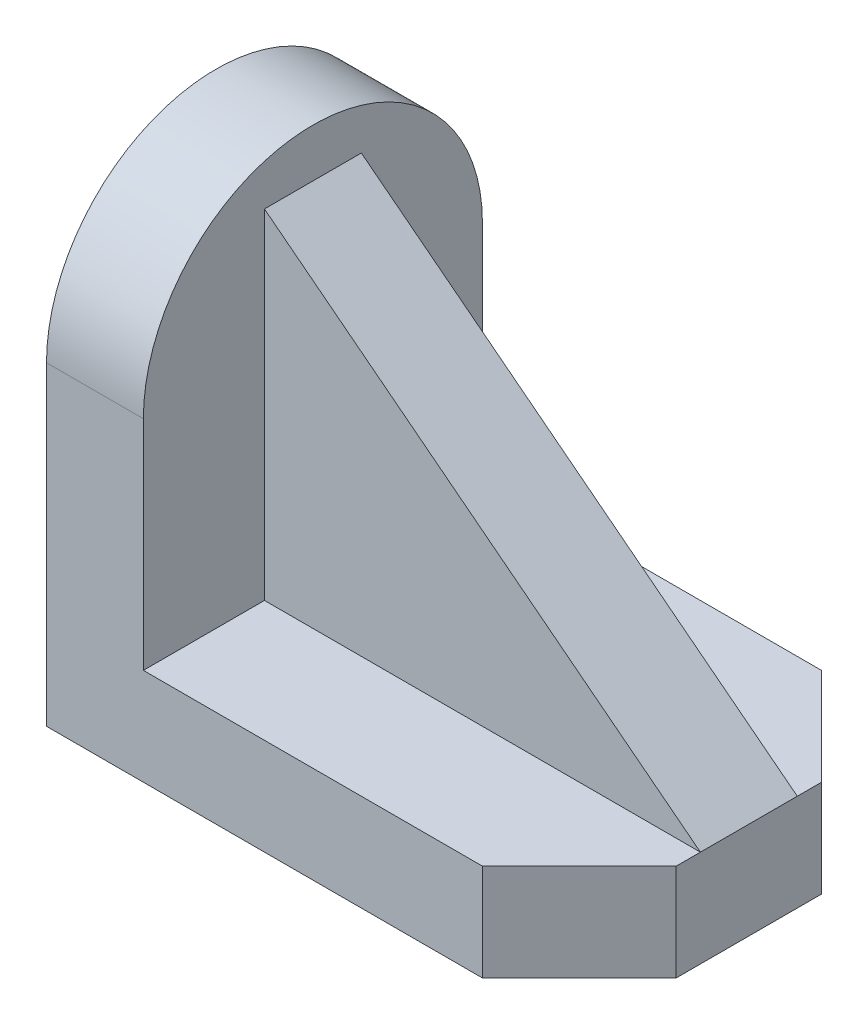
ISO-10303-21;
HEADER;
FILE_DESCRIPTION(('STEP AP214'),'2;1');
FILE_NAME('part.step','',(''),(''),'','','');
FILE_SCHEMA(('AUTOMOTIVE_DESIGN { 1 0 10303 214 1 1 1 1 }'));
ENDSEC;
DATA;
#1=APPLICATION_CONTEXT('core data for automotive mechanical design processes');
#2=APPLICATION_PROTOCOL_DEFINITION('international standard','automotive_design',2000,#1);
#3=PRODUCT_CONTEXT('',#1,'mechanical');
#4=PRODUCT('Part','Part','',(#3));
#5=PRODUCT_RELATED_PRODUCT_CATEGORY('part','',(#4));
#6=PRODUCT_DEFINITION_FORMATION('','',#4);
#7=PRODUCT_DEFINITION_CONTEXT('part definition',#1,'design');
#8=PRODUCT_DEFINITION('design','',#6,#7);
#9=PRODUCT_DEFINITION_SHAPE('','',#8);
#10=(LENGTH_UNIT() NAMED_UNIT(*) SI_UNIT(.MILLI.,.METRE.));
#11=(NAMED_UNIT(*) PLANE_ANGLE_UNIT() SI_UNIT($,.RADIAN.));
#12=(NAMED_UNIT(*) SI_UNIT($,.STERADIAN.) SOLID_ANGLE_UNIT());
#13=UNCERTAINTY_MEASURE_WITH_UNIT(LENGTH_MEASURE(1.E-05),#10,'distance_accuracy_value','');
#14=(GEOMETRIC_REPRESENTATION_CONTEXT(3) GLOBAL_UNCERTAINTY_ASSIGNED_CONTEXT((#13)) GLOBAL_UNIT_ASSIGNED_CONTEXT((#10,
#11,#12)) REPRESENTATION_CONTEXT('',''));
#15=CARTESIAN_POINT('',(0.,0.,0.));
#16=DIRECTION('',(0.,0.,1.));
#17=DIRECTION('',(1.,0.,0.));
#18=AXIS2_PLACEMENT_3D('',#15,#16,#17);
#19=CARTESIAN_POINT('',(0.,12.,0.));
#20=DIRECTION('',(0.,1.,0.));
#21=DIRECTION('',(0.,0.,1.));
#22=AXIS2_PLACEMENT_3D('',#19,#20,#21);
#23=PLANE('',#22);
#24=DIRECTION('',(0.,0.,-1.));
#25=VECTOR('',#24,1.);
#26=CARTESIAN_POINT('',(-21.,12.,0.));
#27=LINE('',#26,#25);
#28=CARTESIAN_POINT('',(-21.,12.,-6.));
#29=VERTEX_POINT('',#28);
#30=CARTESIAN_POINT('',(-21.,12.,-21.));
#31=VERTEX_POINT('',#30);
#32=EDGE_CURVE('E131',#29,#31,#27,.T.);
#33=ORIENTED_EDGE('',*,*,#32,.F.);
#34=DIRECTION('',(1.,0.,0.));
#35=VECTOR('',#34,1.);
#36=CARTESIAN_POINT('',(33.,12.,-6.));
#37=LINE('',#36,#35);
#38=CARTESIAN_POINT('',(33.,12.,-6.));
#39=VERTEX_POINT('',#38);
#40=EDGE_CURVE('E51',#29,#39,#37,.T.);
#41=ORIENTED_EDGE('',*,*,#40,.T.);
#42=DIRECTION('',(0.,0.,-1.));
#43=VECTOR('',#42,1.);
#44=CARTESIAN_POINT('',(33.,12.,-21.));
#45=LINE('',#44,#43);
#46=CARTESIAN_POINT('',(33.,12.,-8.99999999999997));
#47=VERTEX_POINT('',#46);
#48=EDGE_CURVE('E157',#39,#47,#45,.T.);
#49=ORIENTED_EDGE('',*,*,#48,.T.);
#50=DIRECTION('',(0.707106781186548,0.,0.707106781186548));
#51=VECTOR('',#50,1.);
#52=CARTESIAN_POINT('',(21.,12.,-21.));
#53=LINE('',#52,#51);
#54=CARTESIAN_POINT('',(21.,12.,-21.));
#55=VERTEX_POINT('',#54);
#56=EDGE_CURVE('E192',#47,#55,#53,.F.);
#57=ORIENTED_EDGE('',*,*,#56,.T.);
#58=DIRECTION('',(-1.,0.,0.));
#59=VECTOR('',#58,1.);
#60=CARTESIAN_POINT('',(-33.,12.,-21.));
#61=LINE('',#60,#59);
#62=EDGE_CURVE('E156',#55,#31,#61,.T.);
#63=ORIENTED_EDGE('',*,*,#62,.T.);
#64=EDGE_LOOP('',(#33,#41,#49,#57,#63));
#65=FACE_BOUND('',#64,.T.);
#66=ADVANCED_FACE('F35',(#65),#23,.T.);
#67=CARTESIAN_POINT('',(-21.,0.,0.));
#68=DIRECTION('',(1.,0.,0.));
#69=DIRECTION('',(0.,0.,-1.));
#70=AXIS2_PLACEMENT_3D('',#67,#68,#69);
#71=PLANE('',#70);
#72=DIRECTION('',(0.,0.,1.));
#73=VECTOR('',#72,1.);
#74=CARTESIAN_POINT('',(-21.,54.,-6.));
#75=LINE('',#74,#73);
#76=CARTESIAN_POINT('',(-21.,54.,-6.));
#77=VERTEX_POINT('',#76);
#78=CARTESIAN_POINT('',(-21.,54.,6.));
#79=VERTEX_POINT('',#78);
#80=EDGE_CURVE('E150',#77,#79,#75,.T.);
#81=ORIENTED_EDGE('',*,*,#80,.F.);
#82=DIRECTION('',(0.,-1.,0.));
#83=VECTOR('',#82,1.);
#84=CARTESIAN_POINT('',(-21.,12.,-6.));
#85=LINE('',#84,#83);
#86=EDGE_CURVE('E236',#77,#29,#85,.T.);
#87=ORIENTED_EDGE('',*,*,#86,.T.);
#88=ORIENTED_EDGE('',*,*,#32,.T.);
#89=DIRECTION('',(0.,1.,0.));
#90=VECTOR('',#89,1.);
#91=CARTESIAN_POINT('',(-21.,0.,-21.));
#92=LINE('',#91,#90);
#93=CARTESIAN_POINT('',(-21.,39.,-21.));
#94=VERTEX_POINT('',#93);
#95=EDGE_CURVE('E149',#31,#94,#92,.T.);
#96=ORIENTED_EDGE('',*,*,#95,.T.);
#97=CARTESIAN_POINT('',(-21.,39.,0.));
#98=DIRECTION('',(1.,0.,0.));
#99=DIRECTION('',(0.,0.,-1.));
#100=AXIS2_PLACEMENT_3D('',#97,#98,#99);
#101=CIRCLE('',#100,21.);
#102=CARTESIAN_POINT('',(-21.,39.,21.));
#103=VERTEX_POINT('',#102);
#104=EDGE_CURVE('E44',#94,#103,#101,.T.);
#105=ORIENTED_EDGE('',*,*,#104,.T.);
#106=DIRECTION('',(0.,1.,0.));
#107=VECTOR('',#106,1.);
#108=CARTESIAN_POINT('',(-21.,0.,21.));
#109=LINE('',#108,#107);
#110=CARTESIAN_POINT('',(-21.,12.,21.));
#111=VERTEX_POINT('',#110);
#112=EDGE_CURVE('E126',#111,#103,#109,.T.);
#113=ORIENTED_EDGE('',*,*,#112,.F.);
#114=CARTESIAN_POINT('',(-21.,12.,6.));
#115=VERTEX_POINT('',#114);
#116=EDGE_CURVE('E119',#111,#115,#27,.T.);
#117=ORIENTED_EDGE('',*,*,#116,.T.);
#118=DIRECTION('',(0.,-1.,0.));
#119=VECTOR('',#118,1.);
#120=CARTESIAN_POINT('',(-21.,12.,6.));
#121=LINE('',#120,#119);
#122=EDGE_CURVE('E123',#79,#115,#121,.T.);
#123=ORIENTED_EDGE('',*,*,#122,.F.);
#124=EDGE_LOOP('',(#81,#87,#88,#96,#105,#113,#117,#123));
#125=FACE_BOUND('',#124,.T.);
#126=ADVANCED_FACE('F121',(#125),#71,.T.);
#127=CARTESIAN_POINT('',(-21.,39.,0.));
#128=DIRECTION('',(-1.,0.,0.));
#129=DIRECTION('',(0.,0.,1.));
#130=AXIS2_PLACEMENT_3D('',#127,#128,#129);
#131=CYLINDRICAL_SURFACE('',#130,21.);
#132=DIRECTION('',(-1.,0.,0.));
#133=VECTOR('',#132,1.);
#134=CARTESIAN_POINT('',(-33.,39.,21.));
#135=LINE('',#134,#133);
#136=CARTESIAN_POINT('',(-33.,39.,21.));
#137=VERTEX_POINT('',#136);
#138=EDGE_CURVE('E196',#103,#137,#135,.T.);
#139=ORIENTED_EDGE('',*,*,#138,.F.);
#140=ORIENTED_EDGE('',*,*,#104,.F.);
#141=DIRECTION('',(-1.,0.,0.));
#142=VECTOR('',#141,1.);
#143=CARTESIAN_POINT('',(-33.,39.,-21.));
#144=LINE('',#143,#142);
#145=CARTESIAN_POINT('',(-33.,39.,-21.));
#146=VERTEX_POINT('',#145);
#147=EDGE_CURVE('E199',#146,#94,#144,.F.);
#148=ORIENTED_EDGE('',*,*,#147,.F.);
#149=CARTESIAN_POINT('',(-33.,39.,0.));
#150=DIRECTION('',(1.,0.,0.));
#151=DIRECTION('',(0.,0.,-1.));
#152=AXIS2_PLACEMENT_3D('',#149,#150,#151);
#153=CIRCLE('',#152,21.);
#154=EDGE_CURVE('E11',#137,#146,#153,.F.);
#155=ORIENTED_EDGE('',*,*,#154,.F.);
#156=EDGE_LOOP('',(#139,#140,#148,#155));
#157=FACE_BOUND('',#156,.T.);
#158=ADVANCED_FACE('F38',(#157),#131,.T.);
#159=CARTESIAN_POINT('',(33.,12.,-21.));
#160=DIRECTION('',(-1.,0.,0.));
#161=DIRECTION('',(0.,0.,1.));
#162=AXIS2_PLACEMENT_3D('',#159,#160,#161);
#163=PLANE('',#162);
#164=DIRECTION('',(0.,0.,-1.));
#165=VECTOR('',#164,1.);
#166=CARTESIAN_POINT('',(33.,0.,-21.));
#167=LINE('',#166,#165);
#168=CARTESIAN_POINT('',(33.,0.,8.99999999999996));
#169=VERTEX_POINT('',#168);
#170=CARTESIAN_POINT('',(33.,0.,-8.99999999999997));
#171=VERTEX_POINT('',#170);
#172=EDGE_CURVE('E130',#169,#171,#167,.T.);
#173=ORIENTED_EDGE('',*,*,#172,.T.);
#174=DIRECTION('',(0.,1.,0.));
#175=VECTOR('',#174,1.);
#176=CARTESIAN_POINT('',(33.,12.,-8.99999999999996));
#177=LINE('',#176,#175);
#178=EDGE_CURVE('E187',#171,#47,#177,.T.);
#179=ORIENTED_EDGE('',*,*,#178,.T.);
#180=ORIENTED_EDGE('',*,*,#48,.F.);
#181=DIRECTION('',(0.,0.,1.));
#182=VECTOR('',#181,1.);
#183=CARTESIAN_POINT('',(33.,12.,-6.));
#184=LINE('',#183,#182);
#185=CARTESIAN_POINT('',(33.,12.,5.99999999999999));
#186=VERTEX_POINT('',#185);
#187=EDGE_CURVE('E58',#39,#186,#184,.T.);
#188=ORIENTED_EDGE('',*,*,#187,.T.);
#189=CARTESIAN_POINT('',(33.,12.,8.99999999999996));
#190=VERTEX_POINT('',#189);
#191=EDGE_CURVE('E136',#190,#186,#45,.T.);
#192=ORIENTED_EDGE('',*,*,#191,.F.);
#193=DIRECTION('',(0.,-1.,0.));
#194=VECTOR('',#193,1.);
#195=CARTESIAN_POINT('',(33.,12.,8.99999999999996));
#196=LINE('',#195,#194);
#197=EDGE_CURVE('E184',#190,#169,#196,.T.);
#198=ORIENTED_EDGE('',*,*,#197,.T.);
#199=EDGE_LOOP('',(#173,#179,#180,#188,#192,#198));
#200=FACE_BOUND('',#199,.T.);
#201=ADVANCED_FACE('F214',(#200),#163,.F.);
#202=CARTESIAN_POINT('',(-33.,12.,-21.));
#203=DIRECTION('',(0.,0.,1.));
#204=DIRECTION('',(1.,0.,0.));
#205=AXIS2_PLACEMENT_3D('',#202,#203,#204);
#206=PLANE('',#205);
#207=DIRECTION('',(0.,-1.,0.));
#208=VECTOR('',#207,1.);
#209=CARTESIAN_POINT('',(-33.,12.,-21.));
#210=LINE('',#209,#208);
#211=CARTESIAN_POINT('',(-33.,0.,-21.));
#212=VERTEX_POINT('',#211);
#213=EDGE_CURVE('E175',#146,#212,#210,.T.);
#214=ORIENTED_EDGE('',*,*,#213,.F.);
#215=ORIENTED_EDGE('',*,*,#147,.T.);
#216=ORIENTED_EDGE('',*,*,#95,.F.);
#217=ORIENTED_EDGE('',*,*,#62,.F.);
#218=DIRECTION('',(0.,-1.,0.));
#219=VECTOR('',#218,1.);
#220=CARTESIAN_POINT('',(21.,12.,-21.));
#221=LINE('',#220,#219);
#222=CARTESIAN_POINT('',(21.,0.,-21.));
#223=VERTEX_POINT('',#222);
#224=EDGE_CURVE('E177',#55,#223,#221,.T.);
#225=ORIENTED_EDGE('',*,*,#224,.T.);
#226=DIRECTION('',(-1.,0.,0.));
#227=VECTOR('',#226,1.);
#228=CARTESIAN_POINT('',(-33.,0.,-21.));
#229=LINE('',#228,#227);
#230=EDGE_CURVE('E165',#223,#212,#229,.T.);
#231=ORIENTED_EDGE('',*,*,#230,.T.);
#232=EDGE_LOOP('',(#214,#215,#216,#217,#225,#231));
#233=FACE_BOUND('',#232,.T.);
#234=ADVANCED_FACE('F228',(#233),#206,.F.);
#235=CARTESIAN_POINT('',(-33.,12.,-21.));
#236=DIRECTION('',(1.,0.,0.));
#237=DIRECTION('',(0.,0.,-1.));
#238=AXIS2_PLACEMENT_3D('',#235,#236,#237);
#239=PLANE('',#238);
#240=DIRECTION('',(0.,-1.,0.));
#241=VECTOR('',#240,1.);
#242=CARTESIAN_POINT('',(-33.,12.,21.));
#243=LINE('',#242,#241);
#244=CARTESIAN_POINT('',(-33.,0.,21.));
#245=VERTEX_POINT('',#244);
#246=EDGE_CURVE('E162',#137,#245,#243,.T.);
#247=ORIENTED_EDGE('',*,*,#246,.F.);
#248=ORIENTED_EDGE('',*,*,#154,.T.);
#249=ORIENTED_EDGE('',*,*,#213,.T.);
#250=DIRECTION('',(0.,0.,1.));
#251=VECTOR('',#250,1.);
#252=CARTESIAN_POINT('',(-33.,0.,-21.));
#253=LINE('',#252,#251);
#254=EDGE_CURVE('E168',#212,#245,#253,.T.);
#255=ORIENTED_EDGE('',*,*,#254,.T.);
#256=EDGE_LOOP('',(#247,#248,#249,#255));
#257=FACE_BOUND('',#256,.T.);
#258=ADVANCED_FACE('F259',(#257),#239,.F.);
#259=CARTESIAN_POINT('',(-33.,12.,21.));
#260=DIRECTION('',(0.,0.,-1.));
#261=DIRECTION('',(-1.,0.,0.));
#262=AXIS2_PLACEMENT_3D('',#259,#260,#261);
#263=PLANE('',#262);
#264=ORIENTED_EDGE('',*,*,#112,.T.);
#265=ORIENTED_EDGE('',*,*,#138,.T.);
#266=ORIENTED_EDGE('',*,*,#246,.T.);
#267=DIRECTION('',(1.,0.,0.));
#268=VECTOR('',#267,1.);
#269=CARTESIAN_POINT('',(-33.,0.,21.));
#270=LINE('',#269,#268);
#271=CARTESIAN_POINT('',(21.,0.,21.));
#272=VERTEX_POINT('',#271);
#273=EDGE_CURVE('E171',#245,#272,#270,.T.);
#274=ORIENTED_EDGE('',*,*,#273,.T.);
#275=DIRECTION('',(0.,1.,0.));
#276=VECTOR('',#275,1.);
#277=CARTESIAN_POINT('',(21.,12.,21.));
#278=LINE('',#277,#276);
#279=CARTESIAN_POINT('',(21.,12.,21.));
#280=VERTEX_POINT('',#279);
#281=EDGE_CURVE('E194',#272,#280,#278,.T.);
#282=ORIENTED_EDGE('',*,*,#281,.T.);
#283=DIRECTION('',(1.,0.,0.));
#284=VECTOR('',#283,1.);
#285=CARTESIAN_POINT('',(-33.,12.,21.));
#286=LINE('',#285,#284);
#287=EDGE_CURVE('E160',#111,#280,#286,.T.);
#288=ORIENTED_EDGE('',*,*,#287,.F.);
#289=EDGE_LOOP('',(#264,#265,#266,#274,#282,#288));
#290=FACE_BOUND('',#289,.T.);
#291=ADVANCED_FACE('F207',(#290),#263,.F.);
#292=DIRECTION('',(1.,0.,0.));
#293=VECTOR('',#292,1.);
#294=CARTESIAN_POINT('',(33.,12.,6.));
#295=LINE('',#294,#293);
#296=EDGE_CURVE('E134',#115,#186,#295,.T.);
#297=ORIENTED_EDGE('',*,*,#296,.F.);
#298=ORIENTED_EDGE('',*,*,#116,.F.);
#299=ORIENTED_EDGE('',*,*,#287,.T.);
#300=DIRECTION('',(-0.707106781186548,0.,0.707106781186548));
#301=VECTOR('',#300,1.);
#302=CARTESIAN_POINT('',(21.,12.,21.));
#303=LINE('',#302,#301);
#304=EDGE_CURVE('E190',#280,#190,#303,.F.);
#305=ORIENTED_EDGE('',*,*,#304,.T.);
#306=ORIENTED_EDGE('',*,*,#191,.T.);
#307=EDGE_LOOP('',(#297,#298,#299,#305,#306));
#308=FACE_BOUND('',#307,.T.);
#309=ADVANCED_FACE('F135',(#308),#23,.T.);
#310=CARTESIAN_POINT('',(0.,0.,0.));
#311=DIRECTION('',(0.,1.,0.));
#312=DIRECTION('',(0.,0.,1.));
#313=AXIS2_PLACEMENT_3D('',#310,#311,#312);
#314=PLANE('',#313);
#315=ORIENTED_EDGE('',*,*,#230,.F.);
#316=DIRECTION('',(-0.707106781186548,0.,-0.707106781186548));
#317=VECTOR('',#316,1.);
#318=CARTESIAN_POINT('',(21.,0.,-21.));
#319=LINE('',#318,#317);
#320=EDGE_CURVE('E182',#223,#171,#319,.F.);
#321=ORIENTED_EDGE('',*,*,#320,.T.);
#322=ORIENTED_EDGE('',*,*,#172,.F.);
#323=DIRECTION('',(0.707106781186548,0.,-0.707106781186548));
#324=VECTOR('',#323,1.);
#325=CARTESIAN_POINT('',(33.,0.,8.99999999999996));
#326=LINE('',#325,#324);
#327=EDGE_CURVE('E180',#169,#272,#326,.F.);
#328=ORIENTED_EDGE('',*,*,#327,.T.);
#329=ORIENTED_EDGE('',*,*,#273,.F.);
#330=ORIENTED_EDGE('',*,*,#254,.F.);
#331=EDGE_LOOP('',(#315,#321,#322,#328,#329,#330));
#332=FACE_BOUND('',#331,.T.);
#333=ADVANCED_FACE('F218',(#332),#314,.F.);
#334=CARTESIAN_POINT('',(21.,12.,-21.));
#335=DIRECTION('',(-0.707106781186547,0.,0.707106781186547));
#336=DIRECTION('',(0.,-1.,0.));
#337=AXIS2_PLACEMENT_3D('',#334,#335,#336);
#338=PLANE('',#337);
#339=ORIENTED_EDGE('',*,*,#56,.F.);
#340=ORIENTED_EDGE('',*,*,#178,.F.);
#341=ORIENTED_EDGE('',*,*,#320,.F.);
#342=ORIENTED_EDGE('',*,*,#224,.F.);
#343=EDGE_LOOP('',(#339,#340,#341,#342));
#344=FACE_BOUND('',#343,.T.);
#345=ADVANCED_FACE('F224',(#344),#338,.F.);
#346=CARTESIAN_POINT('',(33.,12.,8.99999999999996));
#347=DIRECTION('',(-0.707106781186547,0.,-0.707106781186547));
#348=DIRECTION('',(0.,-1.,0.));
#349=AXIS2_PLACEMENT_3D('',#346,#347,#348);
#350=PLANE('',#349);
#351=ORIENTED_EDGE('',*,*,#304,.F.);
#352=ORIENTED_EDGE('',*,*,#281,.F.);
#353=ORIENTED_EDGE('',*,*,#327,.F.);
#354=ORIENTED_EDGE('',*,*,#197,.F.);
#355=EDGE_LOOP('',(#351,#352,#353,#354));
#356=FACE_BOUND('',#355,.T.);
#357=ADVANCED_FACE('F212',(#356),#350,.F.);
#358=CARTESIAN_POINT('',(-21.,54.,-6.));
#359=DIRECTION('',(0.613940613514921,0.789352217376326,0.));
#360=DIRECTION('',(-0.789352217376326,0.613940613514921,0.));
#361=AXIS2_PLACEMENT_3D('',#358,#359,#360);
#362=PLANE('',#361);
#363=DIRECTION('',(-0.789352217376326,0.61394061351492,0.));
#364=VECTOR('',#363,1.);
#365=CARTESIAN_POINT('',(-21.,54.,6.));
#366=LINE('',#365,#364);
#367=EDGE_CURVE('E143',#186,#79,#366,.T.);
#368=ORIENTED_EDGE('',*,*,#367,.F.);
#369=ORIENTED_EDGE('',*,*,#187,.F.);
#370=DIRECTION('',(-0.789352217376326,0.61394061351492,0.));
#371=VECTOR('',#370,1.);
#372=CARTESIAN_POINT('',(-21.,54.,-6.));
#373=LINE('',#372,#371);
#374=EDGE_CURVE('E140',#39,#77,#373,.T.);
#375=ORIENTED_EDGE('',*,*,#374,.T.);
#376=ORIENTED_EDGE('',*,*,#80,.T.);
#377=EDGE_LOOP('',(#368,#369,#375,#376));
#378=FACE_BOUND('',#377,.T.);
#379=ADVANCED_FACE('F232',(#378),#362,.T.);
#380=CARTESIAN_POINT('',(0.,0.,-6.));
#381=DIRECTION('',(0.,0.,1.));
#382=DIRECTION('',(1.,0.,0.));
#383=AXIS2_PLACEMENT_3D('',#380,#381,#382);
#384=PLANE('',#383);
#385=ORIENTED_EDGE('',*,*,#374,.F.);
#386=ORIENTED_EDGE('',*,*,#40,.F.);
#387=ORIENTED_EDGE('',*,*,#86,.F.);
#388=EDGE_LOOP('',(#385,#386,#387));
#389=FACE_BOUND('',#388,.T.);
#390=ADVANCED_FACE('F235',(#389),#384,.F.);
#391=CARTESIAN_POINT('',(0.,0.,6.));
#392=DIRECTION('',(0.,0.,1.));
#393=DIRECTION('',(1.,0.,0.));
#394=AXIS2_PLACEMENT_3D('',#391,#392,#393);
#395=PLANE('',#394);
#396=ORIENTED_EDGE('',*,*,#367,.T.);
#397=ORIENTED_EDGE('',*,*,#122,.T.);
#398=ORIENTED_EDGE('',*,*,#296,.T.);
#399=EDGE_LOOP('',(#396,#397,#398));
#400=FACE_BOUND('',#399,.T.);
#401=ADVANCED_FACE('F142',(#400),#395,.T.);
#402=CLOSED_SHELL('',(#66,#126,#158,#201,#234,#258,#291,#309,#333,#345,#357,#379,#390,#401));
#403=MANIFOLD_SOLID_BREP('B2',#402);
#404=ADVANCED_BREP_SHAPE_REPRESENTATION('',(#18,#403),#14);
#405=SHAPE_DEFINITION_REPRESENTATION(#9,#404);
ENDSEC;
END-ISO-10303-21;
